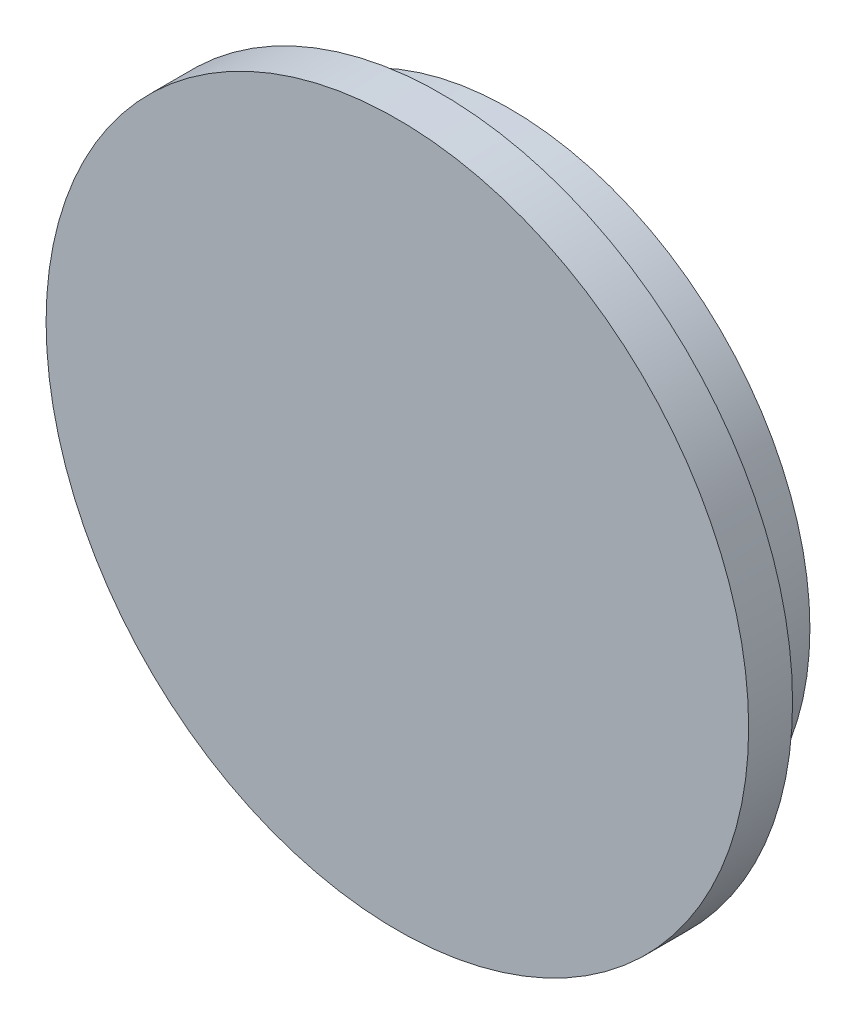
ISO-10303-21;
HEADER;
FILE_DESCRIPTION(('STEP AP214'),'2;1');
FILE_NAME('part.step','',(''),(''),'','','');
FILE_SCHEMA(('AUTOMOTIVE_DESIGN { 1 0 10303 214 1 1 1 1 }'));
ENDSEC;
DATA;
#1=APPLICATION_CONTEXT('core data for automotive mechanical design processes');
#2=APPLICATION_PROTOCOL_DEFINITION('international standard','automotive_design',2000,#1);
#3=PRODUCT_CONTEXT('',#1,'mechanical');
#4=PRODUCT('Part','Part','',(#3));
#5=PRODUCT_RELATED_PRODUCT_CATEGORY('part','',(#4));
#6=PRODUCT_DEFINITION_FORMATION('','',#4);
#7=PRODUCT_DEFINITION_CONTEXT('part definition',#1,'design');
#8=PRODUCT_DEFINITION('design','',#6,#7);
#9=PRODUCT_DEFINITION_SHAPE('','',#8);
#10=(LENGTH_UNIT() NAMED_UNIT(*) SI_UNIT(.MILLI.,.METRE.));
#11=(NAMED_UNIT(*) PLANE_ANGLE_UNIT() SI_UNIT($,.RADIAN.));
#12=(NAMED_UNIT(*) SI_UNIT($,.STERADIAN.) SOLID_ANGLE_UNIT());
#13=UNCERTAINTY_MEASURE_WITH_UNIT(LENGTH_MEASURE(1.E-05),#10,'distance_accuracy_value','');
#14=(GEOMETRIC_REPRESENTATION_CONTEXT(3) GLOBAL_UNCERTAINTY_ASSIGNED_CONTEXT((#13)) GLOBAL_UNIT_ASSIGNED_CONTEXT((#10,
#11,#12)) REPRESENTATION_CONTEXT('',''));
#15=CARTESIAN_POINT('',(0.,0.,0.));
#16=DIRECTION('',(0.,0.,1.));
#17=DIRECTION('',(1.,0.,0.));
#18=AXIS2_PLACEMENT_3D('',#15,#16,#17);
#19=CARTESIAN_POINT('',(0.,0.,1.5));
#20=DIRECTION('',(0.,0.,-1.));
#21=DIRECTION('',(-1.,0.,0.));
#22=AXIS2_PLACEMENT_3D('',#19,#20,#21);
#23=CYLINDRICAL_SURFACE('',#22,12.);
#24=CARTESIAN_POINT('',(0.,0.,1.5));
#25=DIRECTION('',(0.,0.,1.));
#26=DIRECTION('',(1.,0.,0.));
#27=AXIS2_PLACEMENT_3D('',#24,#25,#26);
#28=CIRCLE('',#27,12.);
#29=CARTESIAN_POINT('',(12.,0.,1.5));
#30=VERTEX_POINT('',#29);
#31=EDGE_CURVE('E10',#30,#30,#28,.T.);
#32=ORIENTED_EDGE('',*,*,#31,.F.);
#33=EDGE_LOOP('',(#32));
#34=FACE_BOUND('',#33,.T.);
#35=CARTESIAN_POINT('',(0.,0.,0.));
#36=DIRECTION('',(0.,0.,1.));
#37=DIRECTION('',(1.,0.,0.));
#38=AXIS2_PLACEMENT_3D('',#35,#36,#37);
#39=CIRCLE('',#38,12.);
#40=CARTESIAN_POINT('',(12.,0.,0.));
#41=VERTEX_POINT('',#40);
#42=EDGE_CURVE('E33',#41,#41,#39,.T.);
#43=ORIENTED_EDGE('',*,*,#42,.T.);
#44=EDGE_LOOP('',(#43));
#45=FACE_BOUND('',#44,.T.);
#46=ADVANCED_FACE('F30',(#34,#45),#23,.T.);
#47=CARTESIAN_POINT('',(0.,0.,1.5));
#48=DIRECTION('',(0.,0.,1.));
#49=DIRECTION('',(1.,0.,0.));
#50=AXIS2_PLACEMENT_3D('',#47,#48,#49);
#51=PLANE('',#50);
#52=ORIENTED_EDGE('',*,*,#31,.T.);
#53=EDGE_LOOP('',(#52));
#54=FACE_BOUND('',#53,.T.);
#55=ADVANCED_FACE('F60',(#54),#51,.T.);
#56=CARTESIAN_POINT('',(0.,0.,0.));
#57=DIRECTION('',(0.,0.,1.));
#58=DIRECTION('',(1.,0.,0.));
#59=AXIS2_PLACEMENT_3D('',#56,#57,#58);
#60=PLANE('',#59);
#61=CARTESIAN_POINT('',(0.343006842826565,0.476494590746224,0.));
#62=DIRECTION('',(0.,0.,1.));
#63=DIRECTION('',(1.,0.,0.));
#64=AXIS2_PLACEMENT_3D('',#61,#62,#63);
#65=CIRCLE('',#64,10.25);
#66=CARTESIAN_POINT('',(10.5930068428266,0.476494590746224,0.));
#67=VERTEX_POINT('',#66);
#68=EDGE_CURVE('E42',#67,#67,#65,.T.);
#69=ORIENTED_EDGE('',*,*,#68,.T.);
#70=EDGE_LOOP('',(#69));
#71=FACE_BOUND('',#70,.T.);
#72=ORIENTED_EDGE('',*,*,#42,.F.);
#73=EDGE_LOOP('',(#72));
#74=FACE_BOUND('',#73,.T.);
#75=ADVANCED_FACE('F57',(#71,#74),#60,.F.);
#76=CARTESIAN_POINT('',(0.343006842826565,0.476494590746224,-2.));
#77=DIRECTION('',(0.,0.,1.));
#78=DIRECTION('',(1.,0.,0.));
#79=AXIS2_PLACEMENT_3D('',#76,#77,#78);
#80=CYLINDRICAL_SURFACE('',#79,10.25);
#81=CARTESIAN_POINT('',(0.343006842826565,0.476494590746224,-2.));
#82=DIRECTION('',(0.,0.,1.));
#83=DIRECTION('',(1.,0.,0.));
#84=AXIS2_PLACEMENT_3D('',#81,#82,#83);
#85=CIRCLE('',#84,10.25);
#86=CARTESIAN_POINT('',(10.5930068428266,0.476494590746224,-2.));
#87=VERTEX_POINT('',#86);
#88=EDGE_CURVE('E40',#87,#87,#85,.T.);
#89=ORIENTED_EDGE('',*,*,#88,.T.);
#90=EDGE_LOOP('',(#89));
#91=FACE_BOUND('',#90,.T.);
#92=ORIENTED_EDGE('',*,*,#68,.F.);
#93=EDGE_LOOP('',(#92));
#94=FACE_BOUND('',#93,.T.);
#95=ADVANCED_FACE('F48',(#91,#94),#80,.T.);
#96=CARTESIAN_POINT('',(0.,0.,-2.));
#97=DIRECTION('',(0.,0.,1.));
#98=DIRECTION('',(1.,0.,0.));
#99=AXIS2_PLACEMENT_3D('',#96,#97,#98);
#100=PLANE('',#99);
#101=ORIENTED_EDGE('',*,*,#88,.F.);
#102=EDGE_LOOP('',(#101));
#103=FACE_BOUND('',#102,.T.);
#104=ADVANCED_FACE('F51',(#103),#100,.F.);
#105=CLOSED_SHELL('',(#46,#55,#75,#95,#104));
#106=MANIFOLD_SOLID_BREP('B2',#105);
#107=ADVANCED_BREP_SHAPE_REPRESENTATION('',(#18,#106),#14);
#108=SHAPE_DEFINITION_REPRESENTATION(#9,#107);
ENDSEC;
END-ISO-10303-21;
